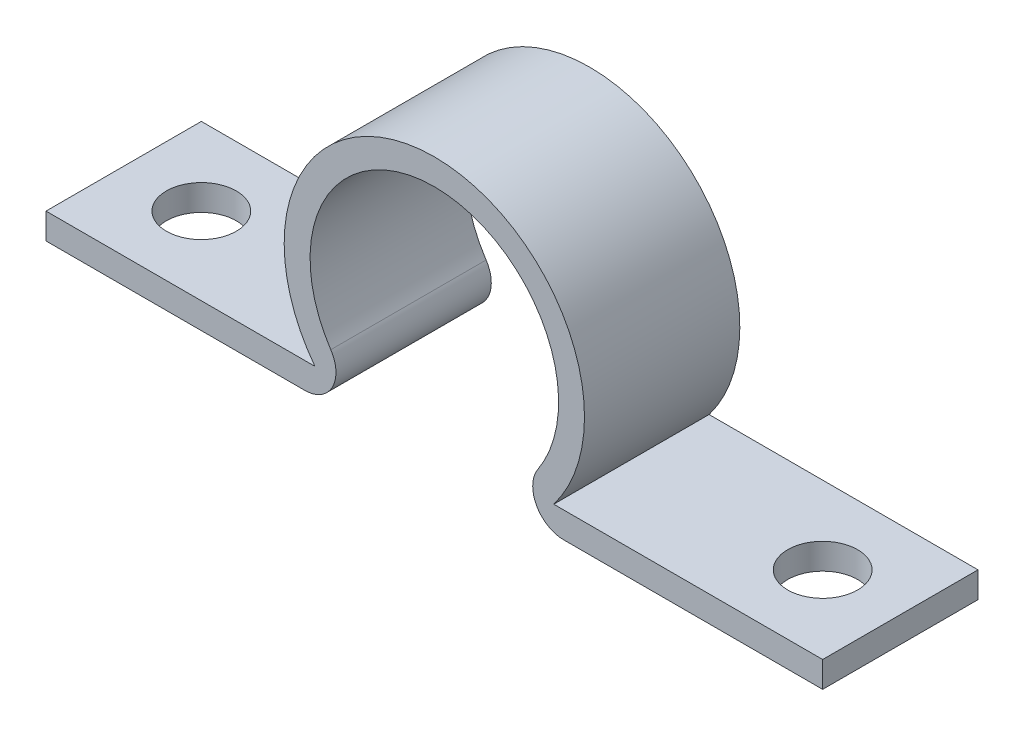
ISO-10303-21;
HEADER;
FILE_DESCRIPTION(('STEP AP214'),'2;1');
FILE_NAME('part.step','',(''),(''),'','','');
FILE_SCHEMA(('AUTOMOTIVE_DESIGN { 1 0 10303 214 1 1 1 1 }'));
ENDSEC;
DATA;
#1=APPLICATION_CONTEXT('core data for automotive mechanical design processes');
#2=APPLICATION_PROTOCOL_DEFINITION('international standard','automotive_design',2000,#1);
#3=PRODUCT_CONTEXT('',#1,'mechanical');
#4=PRODUCT('Part','Part','',(#3));
#5=PRODUCT_RELATED_PRODUCT_CATEGORY('part','',(#4));
#6=PRODUCT_DEFINITION_FORMATION('','',#4);
#7=PRODUCT_DEFINITION_CONTEXT('part definition',#1,'design');
#8=PRODUCT_DEFINITION('design','',#6,#7);
#9=PRODUCT_DEFINITION_SHAPE('','',#8);
#10=(LENGTH_UNIT() NAMED_UNIT(*) SI_UNIT(.MILLI.,.METRE.));
#11=(NAMED_UNIT(*) PLANE_ANGLE_UNIT() SI_UNIT($,.RADIAN.));
#12=(NAMED_UNIT(*) SI_UNIT($,.STERADIAN.) SOLID_ANGLE_UNIT());
#13=UNCERTAINTY_MEASURE_WITH_UNIT(LENGTH_MEASURE(1.E-05),#10,'distance_accuracy_value','');
#14=(GEOMETRIC_REPRESENTATION_CONTEXT(3) GLOBAL_UNCERTAINTY_ASSIGNED_CONTEXT((#13)) GLOBAL_UNIT_ASSIGNED_CONTEXT((#10,
#11,#12)) REPRESENTATION_CONTEXT('',''));
#15=CARTESIAN_POINT('',(0.,0.,0.));
#16=DIRECTION('',(0.,0.,1.));
#17=DIRECTION('',(1.,0.,0.));
#18=AXIS2_PLACEMENT_3D('',#15,#16,#17);
#19=CARTESIAN_POINT('',(0.,5.,30.));
#20=DIRECTION('',(1.,0.,0.));
#21=DIRECTION('',(0.,1.,0.));
#22=AXIS2_PLACEMENT_3D('',#19,#20,#21);
#23=PLANE('',#22);
#24=DIRECTION('',(0.,-1.,0.));
#25=VECTOR('',#24,1.);
#26=CARTESIAN_POINT('',(0.,5.,0.));
#27=LINE('',#26,#25);
#28=CARTESIAN_POINT('',(0.,5.,0.));
#29=VERTEX_POINT('',#28);
#30=CARTESIAN_POINT('',(0.,0.,0.));
#31=VERTEX_POINT('',#30);
#32=EDGE_CURVE('E142',#29,#31,#27,.T.);
#33=ORIENTED_EDGE('',*,*,#32,.T.);
#34=DIRECTION('',(0.,0.,-1.));
#35=VECTOR('',#34,1.);
#36=CARTESIAN_POINT('',(0.,0.,30.));
#37=LINE('',#36,#35);
#38=CARTESIAN_POINT('',(0.,0.,30.));
#39=VERTEX_POINT('',#38);
#40=EDGE_CURVE('E11',#39,#31,#37,.T.);
#41=ORIENTED_EDGE('',*,*,#40,.F.);
#42=DIRECTION('',(0.,-1.,0.));
#43=VECTOR('',#42,1.);
#44=CARTESIAN_POINT('',(0.,5.,30.));
#45=LINE('',#44,#43);
#46=CARTESIAN_POINT('',(0.,5.,30.));
#47=VERTEX_POINT('',#46);
#48=EDGE_CURVE('E162',#47,#39,#45,.T.);
#49=ORIENTED_EDGE('',*,*,#48,.F.);
#50=DIRECTION('',(0.,0.,-1.));
#51=VECTOR('',#50,1.);
#52=CARTESIAN_POINT('',(0.,5.,30.));
#53=LINE('',#52,#51);
#54=EDGE_CURVE('E138',#47,#29,#53,.T.);
#55=ORIENTED_EDGE('',*,*,#54,.T.);
#56=EDGE_LOOP('',(#33,#41,#49,#55));
#57=FACE_BOUND('',#56,.T.);
#58=ADVANCED_FACE('F33',(#57),#23,.F.);
#59=CARTESIAN_POINT('',(0.,0.,30.));
#60=DIRECTION('',(0.,1.,0.));
#61=DIRECTION('',(0.,0.,1.));
#62=AXIS2_PLACEMENT_3D('',#59,#60,#61);
#63=PLANE('',#62);
#64=CARTESIAN_POINT('',(15.,0.,15.));
#65=DIRECTION('',(0.,1.,0.));
#66=DIRECTION('',(0.,0.,1.));
#67=AXIS2_PLACEMENT_3D('',#64,#65,#66);
#68=CIRCLE('',#67,6.74999999999999);
#69=CARTESIAN_POINT('',(15.,0.,21.75));
#70=VERTEX_POINT('',#69);
#71=EDGE_CURVE('E212',#70,#70,#68,.T.);
#72=ORIENTED_EDGE('',*,*,#71,.T.);
#73=EDGE_LOOP('',(#72));
#74=FACE_BOUND('',#73,.T.);
#75=DIRECTION('',(1.,0.,0.));
#76=VECTOR('',#75,1.);
#77=CARTESIAN_POINT('',(0.,0.,0.));
#78=LINE('',#77,#76);
#79=CARTESIAN_POINT('',(50.,0.,0.));
#80=VERTEX_POINT('',#79);
#81=EDGE_CURVE('E145',#31,#80,#78,.T.);
#82=ORIENTED_EDGE('',*,*,#81,.T.);
#83=DIRECTION('',(0.,0.,-1.));
#84=VECTOR('',#83,1.);
#85=CARTESIAN_POINT('',(50.,0.,30.));
#86=LINE('',#85,#84);
#87=CARTESIAN_POINT('',(50.,0.,30.));
#88=VERTEX_POINT('',#87);
#89=EDGE_CURVE('E41',#88,#80,#86,.T.);
#90=ORIENTED_EDGE('',*,*,#89,.F.);
#91=DIRECTION('',(1.,0.,0.));
#92=VECTOR('',#91,1.);
#93=CARTESIAN_POINT('',(0.,0.,30.));
#94=LINE('',#93,#92);
#95=EDGE_CURVE('E96',#39,#88,#94,.T.);
#96=ORIENTED_EDGE('',*,*,#95,.F.);
#97=ORIENTED_EDGE('',*,*,#40,.T.);
#98=EDGE_LOOP('',(#82,#90,#96,#97));
#99=FACE_BOUND('',#98,.T.);
#100=ADVANCED_FACE('F232',(#74,#99),#63,.F.);
#101=CARTESIAN_POINT('',(50.,6.,30.));
#102=DIRECTION('',(0.,0.,-1.));
#103=DIRECTION('',(-1.,0.,0.));
#104=AXIS2_PLACEMENT_3D('',#101,#102,#103);
#105=CYLINDRICAL_SURFACE('',#104,6.);
#106=CARTESIAN_POINT('',(50.,6.,0.));
#107=DIRECTION('',(0.,0.,1.));
#108=DIRECTION('',(1.,0.,0.));
#109=AXIS2_PLACEMENT_3D('',#106,#107,#108);
#110=CIRCLE('',#109,6.);
#111=CARTESIAN_POINT('',(55.,9.3166247903554,0.));
#112=VERTEX_POINT('',#111);
#113=EDGE_CURVE('E148',#80,#112,#110,.T.);
#114=ORIENTED_EDGE('',*,*,#113,.T.);
#115=DIRECTION('',(0.,0.,-1.));
#116=VECTOR('',#115,1.);
#117=CARTESIAN_POINT('',(55.,9.3166247903554,30.));
#118=LINE('',#117,#116);
#119=CARTESIAN_POINT('',(55.,9.3166247903554,30.));
#120=VERTEX_POINT('',#119);
#121=EDGE_CURVE('E175',#120,#112,#118,.T.);
#122=ORIENTED_EDGE('',*,*,#121,.F.);
#123=CARTESIAN_POINT('',(50.,6.,30.));
#124=DIRECTION('',(0.,0.,1.));
#125=DIRECTION('',(1.,0.,0.));
#126=AXIS2_PLACEMENT_3D('',#123,#124,#125);
#127=CIRCLE('',#126,6.);
#128=EDGE_CURVE('E183',#88,#120,#127,.T.);
#129=ORIENTED_EDGE('',*,*,#128,.F.);
#130=ORIENTED_EDGE('',*,*,#89,.T.);
#131=EDGE_LOOP('',(#114,#122,#129,#130));
#132=FACE_BOUND('',#131,.T.);
#133=ADVANCED_FACE('F181',(#132),#105,.T.);
#134=CARTESIAN_POINT('',(75.,22.583123951777,30.));
#135=DIRECTION('',(0.,0.,-1.));
#136=DIRECTION('',(-1.,0.,0.));
#137=AXIS2_PLACEMENT_3D('',#134,#135,#136);
#138=CYLINDRICAL_SURFACE('',#137,24.);
#139=CARTESIAN_POINT('',(75.,22.583123951777,0.));
#140=DIRECTION('',(0.,0.,-1.));
#141=DIRECTION('',(-1.,0.,0.));
#142=AXIS2_PLACEMENT_3D('',#139,#140,#141);
#143=CIRCLE('',#142,24.);
#144=CARTESIAN_POINT('',(95.,9.31662479035541,0.));
#145=VERTEX_POINT('',#144);
#146=EDGE_CURVE('E150',#112,#145,#143,.T.);
#147=ORIENTED_EDGE('',*,*,#146,.T.);
#148=DIRECTION('',(0.,0.,-1.));
#149=VECTOR('',#148,1.);
#150=CARTESIAN_POINT('',(95.,9.31662479035541,30.));
#151=LINE('',#150,#149);
#152=CARTESIAN_POINT('',(95.,9.31662479035541,30.));
#153=VERTEX_POINT('',#152);
#154=EDGE_CURVE('E172',#153,#145,#151,.T.);
#155=ORIENTED_EDGE('',*,*,#154,.F.);
#156=CARTESIAN_POINT('',(75.,22.583123951777,30.));
#157=DIRECTION('',(0.,0.,-1.));
#158=DIRECTION('',(-1.,0.,0.));
#159=AXIS2_PLACEMENT_3D('',#156,#157,#158);
#160=CIRCLE('',#159,24.);
#161=EDGE_CURVE('E199',#120,#153,#160,.T.);
#162=ORIENTED_EDGE('',*,*,#161,.F.);
#163=ORIENTED_EDGE('',*,*,#121,.T.);
#164=EDGE_LOOP('',(#147,#155,#162,#163));
#165=FACE_BOUND('',#164,.T.);
#166=ADVANCED_FACE('F190',(#165),#138,.F.);
#167=CARTESIAN_POINT('',(100.,6.,30.));
#168=DIRECTION('',(0.,0.,-1.));
#169=DIRECTION('',(-1.,0.,0.));
#170=AXIS2_PLACEMENT_3D('',#167,#168,#169);
#171=CYLINDRICAL_SURFACE('',#170,6.);
#172=CARTESIAN_POINT('',(100.,6.,0.));
#173=DIRECTION('',(0.,0.,1.));
#174=DIRECTION('',(1.,0.,0.));
#175=AXIS2_PLACEMENT_3D('',#172,#173,#174);
#176=CIRCLE('',#175,6.);
#177=CARTESIAN_POINT('',(100.,0.,0.));
#178=VERTEX_POINT('',#177);
#179=EDGE_CURVE('E152',#145,#178,#176,.T.);
#180=ORIENTED_EDGE('',*,*,#179,.T.);
#181=DIRECTION('',(0.,0.,-1.));
#182=VECTOR('',#181,1.);
#183=CARTESIAN_POINT('',(100.,0.,30.));
#184=LINE('',#183,#182);
#185=CARTESIAN_POINT('',(100.,0.,30.));
#186=VERTEX_POINT('',#185);
#187=EDGE_CURVE('E169',#186,#178,#184,.T.);
#188=ORIENTED_EDGE('',*,*,#187,.F.);
#189=CARTESIAN_POINT('',(100.,6.,30.));
#190=DIRECTION('',(0.,0.,1.));
#191=DIRECTION('',(1.,0.,0.));
#192=AXIS2_PLACEMENT_3D('',#189,#190,#191);
#193=CIRCLE('',#192,6.);
#194=EDGE_CURVE('E196',#153,#186,#193,.T.);
#195=ORIENTED_EDGE('',*,*,#194,.F.);
#196=ORIENTED_EDGE('',*,*,#154,.T.);
#197=EDGE_LOOP('',(#180,#188,#195,#196));
#198=FACE_BOUND('',#197,.T.);
#199=ADVANCED_FACE('F194',(#198),#171,.T.);
#200=CARTESIAN_POINT('',(100.,0.,30.));
#201=DIRECTION('',(0.,1.,0.));
#202=DIRECTION('',(0.,0.,1.));
#203=AXIS2_PLACEMENT_3D('',#200,#201,#202);
#204=PLANE('',#203);
#205=CARTESIAN_POINT('',(135.,0.,15.));
#206=DIRECTION('',(0.,1.,0.));
#207=DIRECTION('',(0.,0.,1.));
#208=AXIS2_PLACEMENT_3D('',#205,#206,#207);
#209=CIRCLE('',#208,6.74999999999998);
#210=CARTESIAN_POINT('',(135.,0.,21.75));
#211=VERTEX_POINT('',#210);
#212=EDGE_CURVE('E146',#211,#211,#209,.T.);
#213=ORIENTED_EDGE('',*,*,#212,.T.);
#214=EDGE_LOOP('',(#213));
#215=FACE_BOUND('',#214,.T.);
#216=DIRECTION('',(1.,0.,0.));
#217=VECTOR('',#216,1.);
#218=CARTESIAN_POINT('',(100.,0.,0.));
#219=LINE('',#218,#217);
#220=CARTESIAN_POINT('',(150.,0.,0.));
#221=VERTEX_POINT('',#220);
#222=EDGE_CURVE('E154',#178,#221,#219,.T.);
#223=ORIENTED_EDGE('',*,*,#222,.T.);
#224=DIRECTION('',(0.,0.,-1.));
#225=VECTOR('',#224,1.);
#226=CARTESIAN_POINT('',(150.,0.,30.));
#227=LINE('',#226,#225);
#228=CARTESIAN_POINT('',(150.,0.,30.));
#229=VERTEX_POINT('',#228);
#230=EDGE_CURVE('E166',#229,#221,#227,.T.);
#231=ORIENTED_EDGE('',*,*,#230,.F.);
#232=DIRECTION('',(1.,0.,0.));
#233=VECTOR('',#232,1.);
#234=CARTESIAN_POINT('',(100.,0.,30.));
#235=LINE('',#234,#233);
#236=EDGE_CURVE('E198',#186,#229,#235,.T.);
#237=ORIENTED_EDGE('',*,*,#236,.F.);
#238=ORIENTED_EDGE('',*,*,#187,.T.);
#239=EDGE_LOOP('',(#223,#231,#237,#238));
#240=FACE_BOUND('',#239,.T.);
#241=ADVANCED_FACE('F249',(#215,#240),#204,.F.);
#242=CARTESIAN_POINT('',(150.,5.,30.));
#243=DIRECTION('',(-1.,0.,0.));
#244=DIRECTION('',(0.,0.,1.));
#245=AXIS2_PLACEMENT_3D('',#242,#243,#244);
#246=PLANE('',#245);
#247=DIRECTION('',(0.,1.,0.));
#248=VECTOR('',#247,1.);
#249=CARTESIAN_POINT('',(150.,5.,0.));
#250=LINE('',#249,#248);
#251=CARTESIAN_POINT('',(150.,5.,0.));
#252=VERTEX_POINT('',#251);
#253=EDGE_CURVE('E156',#221,#252,#250,.T.);
#254=ORIENTED_EDGE('',*,*,#253,.T.);
#255=DIRECTION('',(0.,0.,-1.));
#256=VECTOR('',#255,1.);
#257=CARTESIAN_POINT('',(150.,5.,30.));
#258=LINE('',#257,#256);
#259=CARTESIAN_POINT('',(150.,5.,30.));
#260=VERTEX_POINT('',#259);
#261=EDGE_CURVE('E133',#260,#252,#258,.T.);
#262=ORIENTED_EDGE('',*,*,#261,.F.);
#263=DIRECTION('',(0.,1.,0.));
#264=VECTOR('',#263,1.);
#265=CARTESIAN_POINT('',(150.,5.,30.));
#266=LINE('',#265,#264);
#267=EDGE_CURVE('E122',#229,#260,#266,.T.);
#268=ORIENTED_EDGE('',*,*,#267,.F.);
#269=ORIENTED_EDGE('',*,*,#230,.T.);
#270=EDGE_LOOP('',(#254,#262,#268,#269));
#271=FACE_BOUND('',#270,.T.);
#272=ADVANCED_FACE('F252',(#271),#246,.F.);
#273=CARTESIAN_POINT('',(98.0615210273834,5.,30.));
#274=DIRECTION('',(0.,-1.,0.));
#275=DIRECTION('',(1.,0.,0.));
#276=AXIS2_PLACEMENT_3D('',#273,#274,#275);
#277=PLANE('',#276);
#278=CARTESIAN_POINT('',(135.,5.00000000000002,15.));
#279=DIRECTION('',(0.,1.,0.));
#280=DIRECTION('',(0.,0.,1.));
#281=AXIS2_PLACEMENT_3D('',#278,#279,#280);
#282=CIRCLE('',#281,6.74999999999998);
#283=CARTESIAN_POINT('',(135.,5.00000000000002,21.75));
#284=VERTEX_POINT('',#283);
#285=EDGE_CURVE('E209',#284,#284,#282,.T.);
#286=ORIENTED_EDGE('',*,*,#285,.F.);
#287=EDGE_LOOP('',(#286));
#288=FACE_BOUND('',#287,.T.);
#289=DIRECTION('',(-1.,0.,0.));
#290=VECTOR('',#289,1.);
#291=CARTESIAN_POINT('',(98.0615210273834,5.,0.));
#292=LINE('',#291,#290);
#293=CARTESIAN_POINT('',(98.0615210273834,5.,0.));
#294=VERTEX_POINT('',#293);
#295=EDGE_CURVE('E131',#252,#294,#292,.T.);
#296=ORIENTED_EDGE('',*,*,#295,.T.);
#297=DIRECTION('',(0.,0.,-1.));
#298=VECTOR('',#297,1.);
#299=CARTESIAN_POINT('',(98.0615210273834,5.,30.));
#300=LINE('',#299,#298);
#301=CARTESIAN_POINT('',(98.0615210273834,5.,30.));
#302=VERTEX_POINT('',#301);
#303=EDGE_CURVE('E128',#302,#294,#300,.T.);
#304=ORIENTED_EDGE('',*,*,#303,.F.);
#305=DIRECTION('',(-1.,0.,0.));
#306=VECTOR('',#305,1.);
#307=CARTESIAN_POINT('',(98.0615210273834,5.,30.));
#308=LINE('',#307,#306);
#309=EDGE_CURVE('E115',#260,#302,#308,.T.);
#310=ORIENTED_EDGE('',*,*,#309,.F.);
#311=ORIENTED_EDGE('',*,*,#261,.T.);
#312=EDGE_LOOP('',(#296,#304,#310,#311));
#313=FACE_BOUND('',#312,.T.);
#314=ADVANCED_FACE('F129',(#288,#313),#277,.F.);
#315=CARTESIAN_POINT('',(75.,22.583123951777,30.));
#316=DIRECTION('',(0.,0.,-1.));
#317=DIRECTION('',(-1.,0.,0.));
#318=AXIS2_PLACEMENT_3D('',#315,#316,#317);
#319=CYLINDRICAL_SURFACE('',#318,29.);
#320=CARTESIAN_POINT('',(75.,22.583123951777,0.));
#321=DIRECTION('',(0.,0.,1.));
#322=DIRECTION('',(-1.,0.,0.));
#323=AXIS2_PLACEMENT_3D('',#320,#321,#322);
#324=CIRCLE('',#323,29.);
#325=CARTESIAN_POINT('',(51.9384789726166,4.99999999999999,0.));
#326=VERTEX_POINT('',#325);
#327=EDGE_CURVE('E159',#294,#326,#324,.T.);
#328=ORIENTED_EDGE('',*,*,#327,.T.);
#329=DIRECTION('',(0.,0.,-1.));
#330=VECTOR('',#329,1.);
#331=CARTESIAN_POINT('',(51.9384789726166,4.99999999999999,30.));
#332=LINE('',#331,#330);
#333=CARTESIAN_POINT('',(51.9384789726166,4.99999999999999,30.));
#334=VERTEX_POINT('',#333);
#335=EDGE_CURVE('E134',#334,#326,#332,.T.);
#336=ORIENTED_EDGE('',*,*,#335,.F.);
#337=CARTESIAN_POINT('',(75.,22.583123951777,30.));
#338=DIRECTION('',(0.,0.,1.));
#339=DIRECTION('',(-1.,0.,0.));
#340=AXIS2_PLACEMENT_3D('',#337,#338,#339);
#341=CIRCLE('',#340,29.);
#342=EDGE_CURVE('E119',#302,#334,#341,.T.);
#343=ORIENTED_EDGE('',*,*,#342,.F.);
#344=ORIENTED_EDGE('',*,*,#303,.T.);
#345=EDGE_LOOP('',(#328,#336,#343,#344));
#346=FACE_BOUND('',#345,.T.);
#347=ADVANCED_FACE('F136',(#346),#319,.T.);
#348=CARTESIAN_POINT('',(0.,5.,30.));
#349=DIRECTION('',(0.,-1.,0.));
#350=DIRECTION('',(1.,0.,0.));
#351=AXIS2_PLACEMENT_3D('',#348,#349,#350);
#352=PLANE('',#351);
#353=CARTESIAN_POINT('',(15.,5.,15.));
#354=DIRECTION('',(0.,1.,0.));
#355=DIRECTION('',(0.,0.,1.));
#356=AXIS2_PLACEMENT_3D('',#353,#354,#355);
#357=CIRCLE('',#356,6.74999999999999);
#358=CARTESIAN_POINT('',(15.,5.,21.75));
#359=VERTEX_POINT('',#358);
#360=EDGE_CURVE('E215',#359,#359,#357,.T.);
#361=ORIENTED_EDGE('',*,*,#360,.F.);
#362=EDGE_LOOP('',(#361));
#363=FACE_BOUND('',#362,.T.);
#364=DIRECTION('',(-1.,0.,0.));
#365=VECTOR('',#364,1.);
#366=CARTESIAN_POINT('',(0.,5.,0.));
#367=LINE('',#366,#365);
#368=EDGE_CURVE('E84',#326,#29,#367,.T.);
#369=ORIENTED_EDGE('',*,*,#368,.T.);
#370=ORIENTED_EDGE('',*,*,#54,.F.);
#371=DIRECTION('',(-1.,0.,0.));
#372=VECTOR('',#371,1.);
#373=CARTESIAN_POINT('',(5.,5.,30.));
#374=LINE('',#373,#372);
#375=EDGE_CURVE('E49',#334,#47,#374,.T.);
#376=ORIENTED_EDGE('',*,*,#375,.F.);
#377=ORIENTED_EDGE('',*,*,#335,.T.);
#378=EDGE_LOOP('',(#369,#370,#376,#377));
#379=FACE_BOUND('',#378,.T.);
#380=ADVANCED_FACE('F221',(#363,#379),#352,.F.);
#381=CARTESIAN_POINT('',(50.,6.,30.));
#382=DIRECTION('',(0.,0.,1.));
#383=DIRECTION('',(1.,0.,0.));
#384=AXIS2_PLACEMENT_3D('',#381,#382,#383);
#385=PLANE('',#384);
#386=ORIENTED_EDGE('',*,*,#48,.T.);
#387=ORIENTED_EDGE('',*,*,#95,.T.);
#388=ORIENTED_EDGE('',*,*,#128,.T.);
#389=ORIENTED_EDGE('',*,*,#161,.T.);
#390=ORIENTED_EDGE('',*,*,#194,.T.);
#391=ORIENTED_EDGE('',*,*,#236,.T.);
#392=ORIENTED_EDGE('',*,*,#267,.T.);
#393=ORIENTED_EDGE('',*,*,#309,.T.);
#394=ORIENTED_EDGE('',*,*,#342,.T.);
#395=ORIENTED_EDGE('',*,*,#375,.T.);
#396=EDGE_LOOP('',(#386,#387,#388,#389,#390,#391,#392,#393,#394,#395));
#397=FACE_BOUND('',#396,.T.);
#398=ADVANCED_FACE('F117',(#397),#385,.T.);
#399=CARTESIAN_POINT('',(50.,6.,0.));
#400=DIRECTION('',(0.,0.,1.));
#401=DIRECTION('',(1.,0.,0.));
#402=AXIS2_PLACEMENT_3D('',#399,#400,#401);
#403=PLANE('',#402);
#404=ORIENTED_EDGE('',*,*,#32,.F.);
#405=ORIENTED_EDGE('',*,*,#368,.F.);
#406=ORIENTED_EDGE('',*,*,#327,.F.);
#407=ORIENTED_EDGE('',*,*,#295,.F.);
#408=ORIENTED_EDGE('',*,*,#253,.F.);
#409=ORIENTED_EDGE('',*,*,#222,.F.);
#410=ORIENTED_EDGE('',*,*,#179,.F.);
#411=ORIENTED_EDGE('',*,*,#146,.F.);
#412=ORIENTED_EDGE('',*,*,#113,.F.);
#413=ORIENTED_EDGE('',*,*,#81,.F.);
#414=EDGE_LOOP('',(#404,#405,#406,#407,#408,#409,#410,#411,#412,#413));
#415=FACE_BOUND('',#414,.T.);
#416=ADVANCED_FACE('F185',(#415),#403,.F.);
#417=CARTESIAN_POINT('',(135.,5.00000000000002,15.));
#418=DIRECTION('',(0.,1.,0.));
#419=DIRECTION('',(0.,0.,1.));
#420=AXIS2_PLACEMENT_3D('',#417,#418,#419);
#421=CYLINDRICAL_SURFACE('',#420,6.74999999999998);
#422=ORIENTED_EDGE('',*,*,#212,.F.);
#423=EDGE_LOOP('',(#422));
#424=FACE_BOUND('',#423,.T.);
#425=ORIENTED_EDGE('',*,*,#285,.T.);
#426=EDGE_LOOP('',(#425));
#427=FACE_BOUND('',#426,.T.);
#428=ADVANCED_FACE('F263',(#424,#427),#421,.F.);
#429=CARTESIAN_POINT('',(15.,5.,15.));
#430=DIRECTION('',(0.,1.,0.));
#431=DIRECTION('',(0.,0.,1.));
#432=AXIS2_PLACEMENT_3D('',#429,#430,#431);
#433=CYLINDRICAL_SURFACE('',#432,6.74999999999999);
#434=ORIENTED_EDGE('',*,*,#71,.F.);
#435=EDGE_LOOP('',(#434));
#436=FACE_BOUND('',#435,.T.);
#437=ORIENTED_EDGE('',*,*,#360,.T.);
#438=EDGE_LOOP('',(#437));
#439=FACE_BOUND('',#438,.T.);
#440=ADVANCED_FACE('F219',(#436,#439),#433,.F.);
#441=CLOSED_SHELL('',(#58,#100,#133,#166,#199,#241,#272,#314,#347,#380,#398,#416,#428,#440));
#442=MANIFOLD_SOLID_BREP('B2',#441);
#443=ADVANCED_BREP_SHAPE_REPRESENTATION('',(#18,#442),#14);
#444=SHAPE_DEFINITION_REPRESENTATION(#9,#443);
ENDSEC;
END-ISO-10303-21;
